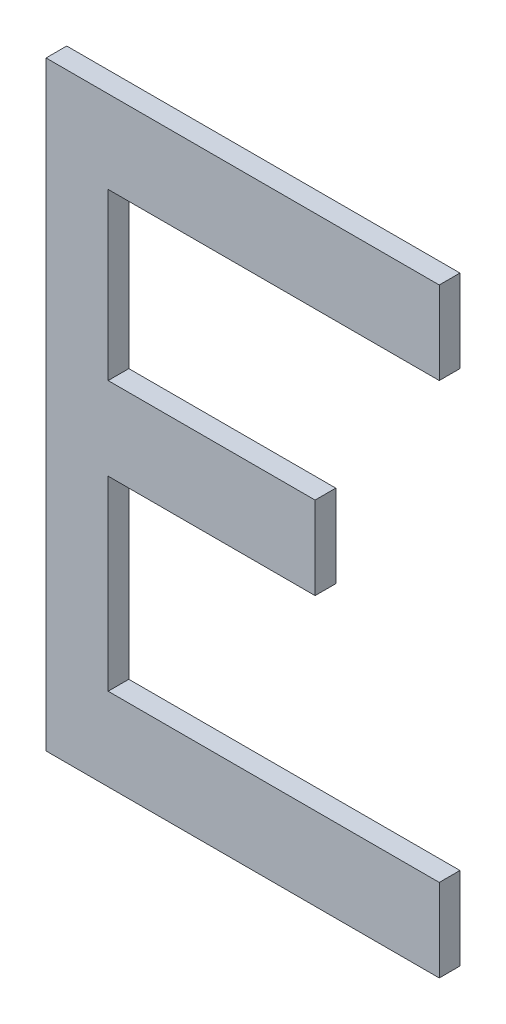
ISO-10303-21;
HEADER;
FILE_DESCRIPTION(('STEP AP214'),'2;1');
FILE_NAME('part.step','',(''),(''),'','','');
FILE_SCHEMA(('AUTOMOTIVE_DESIGN { 1 0 10303 214 1 1 1 1 }'));
ENDSEC;
DATA;
#1=APPLICATION_CONTEXT('core data for automotive mechanical design processes');
#2=APPLICATION_PROTOCOL_DEFINITION('international standard','automotive_design',2000,#1);
#3=PRODUCT_CONTEXT('',#1,'mechanical');
#4=PRODUCT('Part','Part','',(#3));
#5=PRODUCT_RELATED_PRODUCT_CATEGORY('part','',(#4));
#6=PRODUCT_DEFINITION_FORMATION('','',#4);
#7=PRODUCT_DEFINITION_CONTEXT('part definition',#1,'design');
#8=PRODUCT_DEFINITION('design','',#6,#7);
#9=PRODUCT_DEFINITION_SHAPE('','',#8);
#10=(LENGTH_UNIT() NAMED_UNIT(*) SI_UNIT(.MILLI.,.METRE.));
#11=(NAMED_UNIT(*) PLANE_ANGLE_UNIT() SI_UNIT($,.RADIAN.));
#12=(NAMED_UNIT(*) SI_UNIT($,.STERADIAN.) SOLID_ANGLE_UNIT());
#13=UNCERTAINTY_MEASURE_WITH_UNIT(LENGTH_MEASURE(1.E-05),#10,'distance_accuracy_value','');
#14=(GEOMETRIC_REPRESENTATION_CONTEXT(3) GLOBAL_UNCERTAINTY_ASSIGNED_CONTEXT((#13)) GLOBAL_UNIT_ASSIGNED_CONTEXT((#10,
#11,#12)) REPRESENTATION_CONTEXT('',''));
#15=CARTESIAN_POINT('',(0.,0.,0.));
#16=DIRECTION('',(0.,0.,1.));
#17=DIRECTION('',(1.,0.,0.));
#18=AXIS2_PLACEMENT_3D('',#15,#16,#17);
#19=CARTESIAN_POINT('',(-0.09499853999999,0.14500098,0.01));
#20=DIRECTION('',(0.,0.,1.));
#21=DIRECTION('',(1.,0.,0.));
#22=AXIS2_PLACEMENT_3D('',#19,#20,#21);
#23=PLANE('',#22);
#24=DIRECTION('',(0.,1.,0.));
#25=VECTOR('',#24,1.);
#26=CARTESIAN_POINT('',(0.09500108,0.14500098,0.01));
#27=LINE('',#26,#25);
#28=CARTESIAN_POINT('',(0.09500108,0.14500098,0.01));
#29=VERTEX_POINT('',#28);
#30=CARTESIAN_POINT('',(0.09500108,0.10500106,0.01));
#31=VERTEX_POINT('',#30);
#32=EDGE_CURVE('E180',#29,#31,#27,.F.);
#33=ORIENTED_EDGE('',*,*,#32,.F.);
#34=DIRECTION('',(1.,0.,0.));
#35=VECTOR('',#34,1.);
#36=CARTESIAN_POINT('',(-0.09499853999999,0.14500098,0.01));
#37=LINE('',#36,#35);
#38=CARTESIAN_POINT('',(-0.09499853999999,0.14500098,0.01));
#39=VERTEX_POINT('',#38);
#40=EDGE_CURVE('E119',#39,#29,#37,.T.);
#41=ORIENTED_EDGE('',*,*,#40,.F.);
#42=DIRECTION('',(0.,1.,0.));
#43=VECTOR('',#42,1.);
#44=CARTESIAN_POINT('',(-0.09499853999999,-0.14499844,0.01));
#45=LINE('',#44,#43);
#46=CARTESIAN_POINT('',(-0.09499853999999,-0.14499844,0.01));
#47=VERTEX_POINT('',#46);
#48=EDGE_CURVE('E19',#47,#39,#45,.T.);
#49=ORIENTED_EDGE('',*,*,#48,.F.);
#50=DIRECTION('',(1.,0.,0.));
#51=VECTOR('',#50,1.);
#52=CARTESIAN_POINT('',(0.09500108,-0.14499844,0.01));
#53=LINE('',#52,#51);
#54=CARTESIAN_POINT('',(0.09500108,-0.14499844,0.01));
#55=VERTEX_POINT('',#54);
#56=EDGE_CURVE('E107',#55,#47,#53,.F.);
#57=ORIENTED_EDGE('',*,*,#56,.F.);
#58=DIRECTION('',(0.,1.,0.));
#59=VECTOR('',#58,1.);
#60=CARTESIAN_POINT('',(0.09500108,-0.10499852,0.01));
#61=LINE('',#60,#59);
#62=CARTESIAN_POINT('',(0.09500108,-0.10499852,0.01));
#63=VERTEX_POINT('',#62);
#64=EDGE_CURVE('E102',#63,#55,#61,.F.);
#65=ORIENTED_EDGE('',*,*,#64,.F.);
#66=DIRECTION('',(1.,0.,0.));
#67=VECTOR('',#66,1.);
#68=CARTESIAN_POINT('',(-0.0649986,-0.10499852,0.01));
#69=LINE('',#68,#67);
#70=CARTESIAN_POINT('',(-0.0649986,-0.10499852,0.01));
#71=VERTEX_POINT('',#70);
#72=EDGE_CURVE('E138',#71,#63,#69,.T.);
#73=ORIENTED_EDGE('',*,*,#72,.F.);
#74=DIRECTION('',(0.,1.,0.));
#75=VECTOR('',#74,1.);
#76=CARTESIAN_POINT('',(-0.0649986,-0.01499869999999,0.01));
#77=LINE('',#76,#75);
#78=CARTESIAN_POINT('',(-0.0649986,-0.01499869999999,0.01));
#79=VERTEX_POINT('',#78);
#80=EDGE_CURVE('E144',#79,#71,#77,.F.);
#81=ORIENTED_EDGE('',*,*,#80,.F.);
#82=DIRECTION('',(1.,0.,0.));
#83=VECTOR('',#82,1.);
#84=CARTESIAN_POINT('',(0.0350012,-0.01499869999999,0.01));
#85=LINE('',#84,#83);
#86=CARTESIAN_POINT('',(0.0350012,-0.01499869999999,0.01));
#87=VERTEX_POINT('',#86);
#88=EDGE_CURVE('E150',#87,#79,#85,.F.);
#89=ORIENTED_EDGE('',*,*,#88,.F.);
#90=DIRECTION('',(0.,1.,0.));
#91=VECTOR('',#90,1.);
#92=CARTESIAN_POINT('',(0.0350012,0.02500122000001,0.01));
#93=LINE('',#92,#91);
#94=CARTESIAN_POINT('',(0.0350012,0.02500122000001,0.01));
#95=VERTEX_POINT('',#94);
#96=EDGE_CURVE('E156',#95,#87,#93,.F.);
#97=ORIENTED_EDGE('',*,*,#96,.F.);
#98=DIRECTION('',(1.,0.,0.));
#99=VECTOR('',#98,1.);
#100=CARTESIAN_POINT('',(-0.0649986,0.02500122000001,0.01));
#101=LINE('',#100,#99);
#102=CARTESIAN_POINT('',(-0.0649986,0.02500122000001,0.01));
#103=VERTEX_POINT('',#102);
#104=EDGE_CURVE('E162',#103,#95,#101,.T.);
#105=ORIENTED_EDGE('',*,*,#104,.F.);
#106=DIRECTION('',(0.,1.,0.));
#107=VECTOR('',#106,1.);
#108=CARTESIAN_POINT('',(-0.0649986,0.10500106,0.01));
#109=LINE('',#108,#107);
#110=CARTESIAN_POINT('',(-0.0649986,0.10500106,0.01));
#111=VERTEX_POINT('',#110);
#112=EDGE_CURVE('E168',#111,#103,#109,.F.);
#113=ORIENTED_EDGE('',*,*,#112,.F.);
#114=DIRECTION('',(1.,0.,0.));
#115=VECTOR('',#114,1.);
#116=CARTESIAN_POINT('',(0.09500108,0.10500106,0.01));
#117=LINE('',#116,#115);
#118=EDGE_CURVE('E174',#31,#111,#117,.F.);
#119=ORIENTED_EDGE('',*,*,#118,.F.);
#120=EDGE_LOOP('',(#33,#41,#49,#57,#65,#73,#81,#89,#97,#105,#113,#119));
#121=FACE_BOUND('',#120,.T.);
#122=ADVANCED_FACE('F16',(#121),#23,.T.);
#123=CARTESIAN_POINT('',(-0.09499853999999,-0.14499844,0.));
#124=DIRECTION('',(-1.,0.,0.));
#125=DIRECTION('',(0.,0.,1.));
#126=AXIS2_PLACEMENT_3D('',#123,#124,#125);
#127=PLANE('',#126);
#128=DIRECTION('',(0.,0.,1.));
#129=VECTOR('',#128,1.);
#130=CARTESIAN_POINT('',(-0.09499853999999,0.14500098,0.));
#131=LINE('',#130,#129);
#132=CARTESIAN_POINT('',(-0.09499853999999,0.14500098,0.));
#133=VERTEX_POINT('',#132);
#134=EDGE_CURVE('E185',#133,#39,#131,.T.);
#135=ORIENTED_EDGE('',*,*,#134,.F.);
#136=DIRECTION('',(0.,1.,0.));
#137=VECTOR('',#136,1.);
#138=CARTESIAN_POINT('',(-0.09499853999999,0.14500098,0.));
#139=LINE('',#138,#137);
#140=CARTESIAN_POINT('',(-0.09499853999999,-0.14499844,0.));
#141=VERTEX_POINT('',#140);
#142=EDGE_CURVE('E126',#133,#141,#139,.F.);
#143=ORIENTED_EDGE('',*,*,#142,.T.);
#144=DIRECTION('',(0.,0.,-1.));
#145=VECTOR('',#144,1.);
#146=CARTESIAN_POINT('',(-0.09499853999999,-0.14499844,0.));
#147=LINE('',#146,#145);
#148=EDGE_CURVE('E112',#47,#141,#147,.T.);
#149=ORIENTED_EDGE('',*,*,#148,.F.);
#150=ORIENTED_EDGE('',*,*,#48,.T.);
#151=EDGE_LOOP('',(#135,#143,#149,#150));
#152=FACE_BOUND('',#151,.T.);
#153=ADVANCED_FACE('F125',(#152),#127,.T.);
#154=CARTESIAN_POINT('',(0.09500108,-0.14499844,0.));
#155=DIRECTION('',(0.,-1.,0.));
#156=DIRECTION('',(0.,0.,-1.));
#157=AXIS2_PLACEMENT_3D('',#154,#155,#156);
#158=PLANE('',#157);
#159=ORIENTED_EDGE('',*,*,#148,.T.);
#160=DIRECTION('',(1.,0.,0.));
#161=VECTOR('',#160,1.);
#162=CARTESIAN_POINT('',(-0.09499853999999,-0.14499844,0.));
#163=LINE('',#162,#161);
#164=CARTESIAN_POINT('',(0.09500108,-0.14499844,0.));
#165=VERTEX_POINT('',#164);
#166=EDGE_CURVE('E194',#141,#165,#163,.T.);
#167=ORIENTED_EDGE('',*,*,#166,.T.);
#168=DIRECTION('',(0.,0.,-1.));
#169=VECTOR('',#168,1.);
#170=CARTESIAN_POINT('',(0.09500108,-0.14499844,0.));
#171=LINE('',#170,#169);
#172=EDGE_CURVE('E114',#55,#165,#171,.T.);
#173=ORIENTED_EDGE('',*,*,#172,.F.);
#174=ORIENTED_EDGE('',*,*,#56,.T.);
#175=EDGE_LOOP('',(#159,#167,#173,#174));
#176=FACE_BOUND('',#175,.T.);
#177=ADVANCED_FACE('F109',(#176),#158,.T.);
#178=CARTESIAN_POINT('',(0.09500108,-0.10499852,0.));
#179=DIRECTION('',(1.,0.,0.));
#180=DIRECTION('',(0.,0.,-1.));
#181=AXIS2_PLACEMENT_3D('',#178,#179,#180);
#182=PLANE('',#181);
#183=ORIENTED_EDGE('',*,*,#172,.T.);
#184=DIRECTION('',(0.,1.,0.));
#185=VECTOR('',#184,1.);
#186=CARTESIAN_POINT('',(0.09500108,0.14500098,0.));
#187=LINE('',#186,#185);
#188=CARTESIAN_POINT('',(0.09500108,-0.10499852,0.));
#189=VERTEX_POINT('',#188);
#190=EDGE_CURVE('E197',#165,#189,#187,.T.);
#191=ORIENTED_EDGE('',*,*,#190,.T.);
#192=DIRECTION('',(0.,0.,1.));
#193=VECTOR('',#192,1.);
#194=CARTESIAN_POINT('',(0.09500108,-0.10499852,0.));
#195=LINE('',#194,#193);
#196=EDGE_CURVE('E141',#63,#189,#195,.F.);
#197=ORIENTED_EDGE('',*,*,#196,.F.);
#198=ORIENTED_EDGE('',*,*,#64,.T.);
#199=EDGE_LOOP('',(#183,#191,#197,#198));
#200=FACE_BOUND('',#199,.T.);
#201=ADVANCED_FACE('F272',(#200),#182,.T.);
#202=CARTESIAN_POINT('',(-0.0649986,-0.10499852,0.));
#203=DIRECTION('',(0.,1.,0.));
#204=DIRECTION('',(0.,0.,1.));
#205=AXIS2_PLACEMENT_3D('',#202,#203,#204);
#206=PLANE('',#205);
#207=ORIENTED_EDGE('',*,*,#196,.T.);
#208=DIRECTION('',(1.,0.,0.));
#209=VECTOR('',#208,1.);
#210=CARTESIAN_POINT('',(-0.09499853999999,-0.10499852,0.));
#211=LINE('',#210,#209);
#212=CARTESIAN_POINT('',(-0.0649986,-0.10499852,0.));
#213=VERTEX_POINT('',#212);
#214=EDGE_CURVE('E201',#189,#213,#211,.F.);
#215=ORIENTED_EDGE('',*,*,#214,.T.);
#216=DIRECTION('',(0.,0.,-1.));
#217=VECTOR('',#216,1.);
#218=CARTESIAN_POINT('',(-0.0649986,-0.10499852,0.));
#219=LINE('',#218,#217);
#220=EDGE_CURVE('E147',#71,#213,#219,.T.);
#221=ORIENTED_EDGE('',*,*,#220,.F.);
#222=ORIENTED_EDGE('',*,*,#72,.T.);
#223=EDGE_LOOP('',(#207,#215,#221,#222));
#224=FACE_BOUND('',#223,.T.);
#225=ADVANCED_FACE('F271',(#224),#206,.T.);
#226=CARTESIAN_POINT('',(-0.0649986,-0.01499869999999,0.));
#227=DIRECTION('',(1.,0.,0.));
#228=DIRECTION('',(0.,0.,-1.));
#229=AXIS2_PLACEMENT_3D('',#226,#227,#228);
#230=PLANE('',#229);
#231=ORIENTED_EDGE('',*,*,#220,.T.);
#232=DIRECTION('',(0.,1.,0.));
#233=VECTOR('',#232,1.);
#234=CARTESIAN_POINT('',(-0.0649986,0.14500098,0.));
#235=LINE('',#234,#233);
#236=CARTESIAN_POINT('',(-0.0649986,-0.01499869999999,0.));
#237=VERTEX_POINT('',#236);
#238=EDGE_CURVE('E204',#213,#237,#235,.T.);
#239=ORIENTED_EDGE('',*,*,#238,.T.);
#240=DIRECTION('',(0.,0.,-1.));
#241=VECTOR('',#240,1.);
#242=CARTESIAN_POINT('',(-0.0649986,-0.01499869999999,0.));
#243=LINE('',#242,#241);
#244=EDGE_CURVE('E153',#79,#237,#243,.T.);
#245=ORIENTED_EDGE('',*,*,#244,.F.);
#246=ORIENTED_EDGE('',*,*,#80,.T.);
#247=EDGE_LOOP('',(#231,#239,#245,#246));
#248=FACE_BOUND('',#247,.T.);
#249=ADVANCED_FACE('F265',(#248),#230,.T.);
#250=CARTESIAN_POINT('',(0.0350012,-0.01499869999999,0.));
#251=DIRECTION('',(0.,-1.,0.));
#252=DIRECTION('',(0.,0.,-1.));
#253=AXIS2_PLACEMENT_3D('',#250,#251,#252);
#254=PLANE('',#253);
#255=ORIENTED_EDGE('',*,*,#244,.T.);
#256=DIRECTION('',(1.,0.,0.));
#257=VECTOR('',#256,1.);
#258=CARTESIAN_POINT('',(-0.09499853999999,-0.01499869999999,0.));
#259=LINE('',#258,#257);
#260=CARTESIAN_POINT('',(0.0350012,-0.01499869999999,0.));
#261=VERTEX_POINT('',#260);
#262=EDGE_CURVE('E208',#237,#261,#259,.T.);
#263=ORIENTED_EDGE('',*,*,#262,.T.);
#264=DIRECTION('',(0.,0.,-1.));
#265=VECTOR('',#264,1.);
#266=CARTESIAN_POINT('',(0.0350012,-0.01499869999999,0.));
#267=LINE('',#266,#265);
#268=EDGE_CURVE('E159',#87,#261,#267,.T.);
#269=ORIENTED_EDGE('',*,*,#268,.F.);
#270=ORIENTED_EDGE('',*,*,#88,.T.);
#271=EDGE_LOOP('',(#255,#263,#269,#270));
#272=FACE_BOUND('',#271,.T.);
#273=ADVANCED_FACE('F261',(#272),#254,.T.);
#274=CARTESIAN_POINT('',(0.0350012,0.02500122000001,0.));
#275=DIRECTION('',(1.,0.,0.));
#276=DIRECTION('',(0.,0.,-1.));
#277=AXIS2_PLACEMENT_3D('',#274,#275,#276);
#278=PLANE('',#277);
#279=ORIENTED_EDGE('',*,*,#268,.T.);
#280=DIRECTION('',(0.,1.,0.));
#281=VECTOR('',#280,1.);
#282=CARTESIAN_POINT('',(0.0350012,0.14500098,0.));
#283=LINE('',#282,#281);
#284=CARTESIAN_POINT('',(0.0350012,0.02500122000001,0.));
#285=VERTEX_POINT('',#284);
#286=EDGE_CURVE('E212',#261,#285,#283,.T.);
#287=ORIENTED_EDGE('',*,*,#286,.T.);
#288=DIRECTION('',(0.,0.,1.));
#289=VECTOR('',#288,1.);
#290=CARTESIAN_POINT('',(0.0350012,0.02500122000001,0.));
#291=LINE('',#290,#289);
#292=EDGE_CURVE('E165',#95,#285,#291,.F.);
#293=ORIENTED_EDGE('',*,*,#292,.F.);
#294=ORIENTED_EDGE('',*,*,#96,.T.);
#295=EDGE_LOOP('',(#279,#287,#293,#294));
#296=FACE_BOUND('',#295,.T.);
#297=ADVANCED_FACE('F255',(#296),#278,.T.);
#298=CARTESIAN_POINT('',(-0.0649986,0.02500122000001,0.));
#299=DIRECTION('',(0.,1.,0.));
#300=DIRECTION('',(0.,0.,1.));
#301=AXIS2_PLACEMENT_3D('',#298,#299,#300);
#302=PLANE('',#301);
#303=ORIENTED_EDGE('',*,*,#292,.T.);
#304=DIRECTION('',(1.,0.,0.));
#305=VECTOR('',#304,1.);
#306=CARTESIAN_POINT('',(-0.09499853999999,0.02500122000001,0.));
#307=LINE('',#306,#305);
#308=CARTESIAN_POINT('',(-0.0649986,0.02500122000001,0.));
#309=VERTEX_POINT('',#308);
#310=EDGE_CURVE('E216',#285,#309,#307,.F.);
#311=ORIENTED_EDGE('',*,*,#310,.T.);
#312=DIRECTION('',(0.,0.,-1.));
#313=VECTOR('',#312,1.);
#314=CARTESIAN_POINT('',(-0.0649986,0.02500122000001,0.));
#315=LINE('',#314,#313);
#316=EDGE_CURVE('E171',#103,#309,#315,.T.);
#317=ORIENTED_EDGE('',*,*,#316,.F.);
#318=ORIENTED_EDGE('',*,*,#104,.T.);
#319=EDGE_LOOP('',(#303,#311,#317,#318));
#320=FACE_BOUND('',#319,.T.);
#321=ADVANCED_FACE('F251',(#320),#302,.T.);
#322=CARTESIAN_POINT('',(-0.0649986,0.10500106,0.));
#323=DIRECTION('',(1.,0.,0.));
#324=DIRECTION('',(0.,0.,-1.));
#325=AXIS2_PLACEMENT_3D('',#322,#323,#324);
#326=PLANE('',#325);
#327=ORIENTED_EDGE('',*,*,#316,.T.);
#328=DIRECTION('',(0.,1.,0.));
#329=VECTOR('',#328,1.);
#330=CARTESIAN_POINT('',(-0.0649986,0.14500098,0.));
#331=LINE('',#330,#329);
#332=CARTESIAN_POINT('',(-0.0649986,0.10500106,0.));
#333=VERTEX_POINT('',#332);
#334=EDGE_CURVE('E220',#309,#333,#331,.T.);
#335=ORIENTED_EDGE('',*,*,#334,.T.);
#336=DIRECTION('',(0.,0.,-1.));
#337=VECTOR('',#336,1.);
#338=CARTESIAN_POINT('',(-0.0649986,0.10500106,0.));
#339=LINE('',#338,#337);
#340=EDGE_CURVE('E177',#111,#333,#339,.T.);
#341=ORIENTED_EDGE('',*,*,#340,.F.);
#342=ORIENTED_EDGE('',*,*,#112,.T.);
#343=EDGE_LOOP('',(#327,#335,#341,#342));
#344=FACE_BOUND('',#343,.T.);
#345=ADVANCED_FACE('F245',(#344),#326,.T.);
#346=CARTESIAN_POINT('',(0.09500108,0.10500106,0.));
#347=DIRECTION('',(0.,-1.,0.));
#348=DIRECTION('',(0.,0.,-1.));
#349=AXIS2_PLACEMENT_3D('',#346,#347,#348);
#350=PLANE('',#349);
#351=ORIENTED_EDGE('',*,*,#340,.T.);
#352=DIRECTION('',(1.,0.,0.));
#353=VECTOR('',#352,1.);
#354=CARTESIAN_POINT('',(-0.09499853999999,0.10500106,0.));
#355=LINE('',#354,#353);
#356=CARTESIAN_POINT('',(0.09500108,0.10500106,0.));
#357=VERTEX_POINT('',#356);
#358=EDGE_CURVE('E224',#333,#357,#355,.T.);
#359=ORIENTED_EDGE('',*,*,#358,.T.);
#360=DIRECTION('',(0.,0.,-1.));
#361=VECTOR('',#360,1.);
#362=CARTESIAN_POINT('',(0.09500108,0.10500106,0.));
#363=LINE('',#362,#361);
#364=EDGE_CURVE('E182',#31,#357,#363,.T.);
#365=ORIENTED_EDGE('',*,*,#364,.F.);
#366=ORIENTED_EDGE('',*,*,#118,.T.);
#367=EDGE_LOOP('',(#351,#359,#365,#366));
#368=FACE_BOUND('',#367,.T.);
#369=ADVANCED_FACE('F240',(#368),#350,.T.);
#370=CARTESIAN_POINT('',(0.09500108,0.14500098,0.));
#371=DIRECTION('',(1.,0.,0.));
#372=DIRECTION('',(0.,0.,-1.));
#373=AXIS2_PLACEMENT_3D('',#370,#371,#372);
#374=PLANE('',#373);
#375=ORIENTED_EDGE('',*,*,#364,.T.);
#376=DIRECTION('',(0.,1.,0.));
#377=VECTOR('',#376,1.);
#378=CARTESIAN_POINT('',(0.09500108,0.14500098,0.));
#379=LINE('',#378,#377);
#380=CARTESIAN_POINT('',(0.09500108,0.14500098,0.));
#381=VERTEX_POINT('',#380);
#382=EDGE_CURVE('E26',#357,#381,#379,.T.);
#383=ORIENTED_EDGE('',*,*,#382,.T.);
#384=DIRECTION('',(0.,0.,1.));
#385=VECTOR('',#384,1.);
#386=CARTESIAN_POINT('',(0.09500108,0.14500098,0.));
#387=LINE('',#386,#385);
#388=EDGE_CURVE('E34',#29,#381,#387,.F.);
#389=ORIENTED_EDGE('',*,*,#388,.F.);
#390=ORIENTED_EDGE('',*,*,#32,.T.);
#391=EDGE_LOOP('',(#375,#383,#389,#390));
#392=FACE_BOUND('',#391,.T.);
#393=ADVANCED_FACE('F233',(#392),#374,.T.);
#394=CARTESIAN_POINT('',(-0.09499853999999,0.14500098,0.));
#395=DIRECTION('',(0.,1.,0.));
#396=DIRECTION('',(0.,0.,1.));
#397=AXIS2_PLACEMENT_3D('',#394,#395,#396);
#398=PLANE('',#397);
#399=ORIENTED_EDGE('',*,*,#388,.T.);
#400=DIRECTION('',(1.,0.,0.));
#401=VECTOR('',#400,1.);
#402=CARTESIAN_POINT('',(-0.09499853999999,0.14500098,0.));
#403=LINE('',#402,#401);
#404=EDGE_CURVE('E11',#381,#133,#403,.F.);
#405=ORIENTED_EDGE('',*,*,#404,.T.);
#406=ORIENTED_EDGE('',*,*,#134,.T.);
#407=ORIENTED_EDGE('',*,*,#40,.T.);
#408=EDGE_LOOP('',(#399,#405,#406,#407));
#409=FACE_BOUND('',#408,.T.);
#410=ADVANCED_FACE('F273',(#409),#398,.T.);
#411=CARTESIAN_POINT('',(-0.09499853999999,0.14500098,0.));
#412=DIRECTION('',(0.,0.,1.));
#413=DIRECTION('',(1.,0.,0.));
#414=AXIS2_PLACEMENT_3D('',#411,#412,#413);
#415=PLANE('',#414);
#416=ORIENTED_EDGE('',*,*,#382,.F.);
#417=ORIENTED_EDGE('',*,*,#358,.F.);
#418=ORIENTED_EDGE('',*,*,#334,.F.);
#419=ORIENTED_EDGE('',*,*,#310,.F.);
#420=ORIENTED_EDGE('',*,*,#286,.F.);
#421=ORIENTED_EDGE('',*,*,#262,.F.);
#422=ORIENTED_EDGE('',*,*,#238,.F.);
#423=ORIENTED_EDGE('',*,*,#214,.F.);
#424=ORIENTED_EDGE('',*,*,#190,.F.);
#425=ORIENTED_EDGE('',*,*,#166,.F.);
#426=ORIENTED_EDGE('',*,*,#142,.F.);
#427=ORIENTED_EDGE('',*,*,#404,.F.);
#428=EDGE_LOOP('',(#416,#417,#418,#419,#420,#421,#422,#423,#424,#425,#426,#427));
#429=FACE_BOUND('',#428,.T.);
#430=ADVANCED_FACE('F237',(#429),#415,.F.);
#431=CLOSED_SHELL('',(#122,#153,#177,#201,#225,#249,#273,#297,#321,#345,#369,#393,#410,#430));
#432=MANIFOLD_SOLID_BREP('B1',#431);
#433=ADVANCED_BREP_SHAPE_REPRESENTATION('',(#18,#432),#14);
#434=SHAPE_DEFINITION_REPRESENTATION(#9,#433);
ENDSEC;
END-ISO-10303-21;
